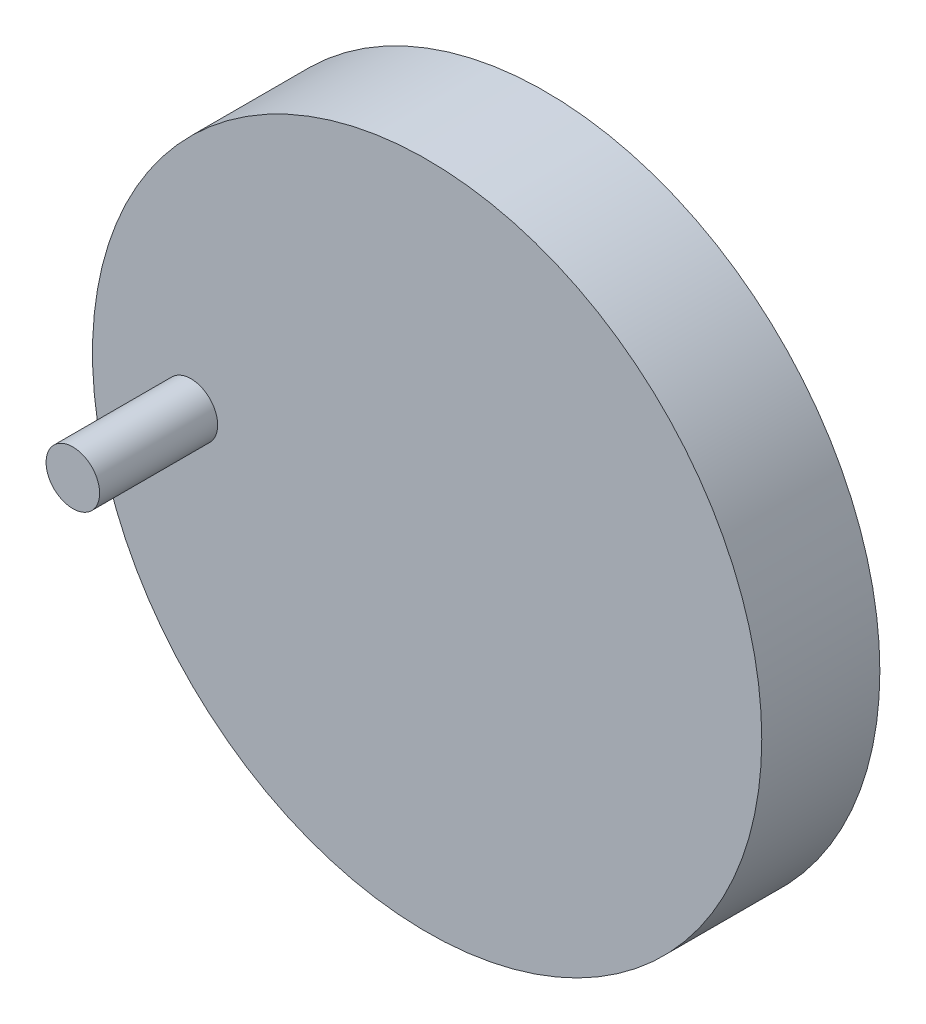
ISO-10303-21;
HEADER;
FILE_DESCRIPTION(('STEP AP214'),'2;1');
FILE_NAME('part.step','',(''),(''),'','','');
FILE_SCHEMA(('AUTOMOTIVE_DESIGN { 1 0 10303 214 1 1 1 1 }'));
ENDSEC;
DATA;
#1=APPLICATION_CONTEXT('core data for automotive mechanical design processes');
#2=APPLICATION_PROTOCOL_DEFINITION('international standard','automotive_design',2000,#1);
#3=PRODUCT_CONTEXT('',#1,'mechanical');
#4=PRODUCT('Part','Part','',(#3));
#5=PRODUCT_RELATED_PRODUCT_CATEGORY('part','',(#4));
#6=PRODUCT_DEFINITION_FORMATION('','',#4);
#7=PRODUCT_DEFINITION_CONTEXT('part definition',#1,'design');
#8=PRODUCT_DEFINITION('design','',#6,#7);
#9=PRODUCT_DEFINITION_SHAPE('','',#8);
#10=(LENGTH_UNIT() NAMED_UNIT(*) SI_UNIT(.MILLI.,.METRE.));
#11=(NAMED_UNIT(*) PLANE_ANGLE_UNIT() SI_UNIT($,.RADIAN.));
#12=(NAMED_UNIT(*) SI_UNIT($,.STERADIAN.) SOLID_ANGLE_UNIT());
#13=UNCERTAINTY_MEASURE_WITH_UNIT(LENGTH_MEASURE(1.E-05),#10,'distance_accuracy_value','');
#14=(GEOMETRIC_REPRESENTATION_CONTEXT(3) GLOBAL_UNCERTAINTY_ASSIGNED_CONTEXT((#13)) GLOBAL_UNIT_ASSIGNED_CONTEXT((#10,
#11,#12)) REPRESENTATION_CONTEXT('',''));
#15=CARTESIAN_POINT('',(0.,0.,0.));
#16=DIRECTION('',(0.,0.,1.));
#17=DIRECTION('',(1.,0.,0.));
#18=AXIS2_PLACEMENT_3D('',#15,#16,#17);
#19=CARTESIAN_POINT('',(0.,0.,10.));
#20=DIRECTION('',(0.,0.,1.));
#21=DIRECTION('',(1.,0.,0.));
#22=AXIS2_PLACEMENT_3D('',#19,#20,#21);
#23=PLANE('',#22);
#24=CARTESIAN_POINT('',(0.,0.,10.));
#25=DIRECTION('',(0.,0.,1.));
#26=DIRECTION('',(1.,0.,0.));
#27=AXIS2_PLACEMENT_3D('',#24,#25,#26);
#28=CIRCLE('',#27,28.3374661356318);
#29=CARTESIAN_POINT('',(28.3374661356318,0.,10.));
#30=VERTEX_POINT('',#29);
#31=EDGE_CURVE('E10',#30,#30,#28,.T.);
#32=ORIENTED_EDGE('',*,*,#31,.T.);
#33=EDGE_LOOP('',(#32));
#34=FACE_BOUND('',#33,.T.);
#35=CARTESIAN_POINT('',(-20.,0.,10.));
#36=DIRECTION('',(0.,0.,1.));
#37=DIRECTION('',(1.,0.,0.));
#38=AXIS2_PLACEMENT_3D('',#35,#36,#37);
#39=CIRCLE('',#38,2.26699729085055);
#40=CARTESIAN_POINT('',(-17.7330027091494,0.,10.));
#41=VERTEX_POINT('',#40);
#42=EDGE_CURVE('E41',#41,#41,#39,.T.);
#43=ORIENTED_EDGE('',*,*,#42,.F.);
#44=EDGE_LOOP('',(#43));
#45=FACE_BOUND('',#44,.T.);
#46=ADVANCED_FACE('F30',(#34,#45),#23,.T.);
#47=CARTESIAN_POINT('',(0.,0.,0.));
#48=DIRECTION('',(0.,0.,1.));
#49=DIRECTION('',(1.,0.,0.));
#50=AXIS2_PLACEMENT_3D('',#47,#48,#49);
#51=PLANE('',#50);
#52=CARTESIAN_POINT('',(0.,0.,0.));
#53=DIRECTION('',(0.,0.,1.));
#54=DIRECTION('',(1.,0.,0.));
#55=AXIS2_PLACEMENT_3D('',#52,#53,#54);
#56=CIRCLE('',#55,2.26699729085055);
#57=CARTESIAN_POINT('',(2.26699729085055,0.,0.));
#58=VERTEX_POINT('',#57);
#59=EDGE_CURVE('E45',#58,#58,#56,.F.);
#60=ORIENTED_EDGE('',*,*,#59,.F.);
#61=EDGE_LOOP('',(#60));
#62=FACE_BOUND('',#61,.T.);
#63=CARTESIAN_POINT('',(0.,0.,0.));
#64=DIRECTION('',(0.,0.,1.));
#65=DIRECTION('',(1.,0.,0.));
#66=AXIS2_PLACEMENT_3D('',#63,#64,#65);
#67=CIRCLE('',#66,28.3374661356318);
#68=CARTESIAN_POINT('',(28.3374661356318,0.,0.));
#69=VERTEX_POINT('',#68);
#70=EDGE_CURVE('E34',#69,#69,#67,.T.);
#71=ORIENTED_EDGE('',*,*,#70,.F.);
#72=EDGE_LOOP('',(#71));
#73=FACE_BOUND('',#72,.T.);
#74=ADVANCED_FACE('F71',(#62,#73),#51,.F.);
#75=CARTESIAN_POINT('',(0.,0.,10.));
#76=DIRECTION('',(0.,0.,-1.));
#77=DIRECTION('',(-1.,0.,0.));
#78=AXIS2_PLACEMENT_3D('',#75,#76,#77);
#79=CYLINDRICAL_SURFACE('',#78,28.3374661356318);
#80=ORIENTED_EDGE('',*,*,#31,.F.);
#81=EDGE_LOOP('',(#80));
#82=FACE_BOUND('',#81,.T.);
#83=ORIENTED_EDGE('',*,*,#70,.T.);
#84=EDGE_LOOP('',(#83));
#85=FACE_BOUND('',#84,.T.);
#86=ADVANCED_FACE('F32',(#82,#85),#79,.T.);
#87=CARTESIAN_POINT('',(0.,0.,10.));
#88=DIRECTION('',(0.,0.,-1.));
#89=DIRECTION('',(-1.,0.,0.));
#90=AXIS2_PLACEMENT_3D('',#87,#88,#89);
#91=CYLINDRICAL_SURFACE('',#90,2.26699729085055);
#92=CARTESIAN_POINT('',(0.,0.,-10.));
#93=DIRECTION('',(0.,0.,1.));
#94=DIRECTION('',(1.,0.,0.));
#95=AXIS2_PLACEMENT_3D('',#92,#93,#94);
#96=CIRCLE('',#95,2.26699729085055);
#97=CARTESIAN_POINT('',(2.26699729085055,0.,-10.));
#98=VERTEX_POINT('',#97);
#99=EDGE_CURVE('E48',#98,#98,#96,.T.);
#100=ORIENTED_EDGE('',*,*,#99,.T.);
#101=EDGE_LOOP('',(#100));
#102=FACE_BOUND('',#101,.T.);
#103=ORIENTED_EDGE('',*,*,#59,.T.);
#104=EDGE_LOOP('',(#103));
#105=FACE_BOUND('',#104,.T.);
#106=ADVANCED_FACE('F67',(#102,#105),#91,.T.);
#107=CARTESIAN_POINT('',(0.,0.,-10.));
#108=DIRECTION('',(0.,0.,1.));
#109=DIRECTION('',(1.,0.,0.));
#110=AXIS2_PLACEMENT_3D('',#107,#108,#109);
#111=PLANE('',#110);
#112=ORIENTED_EDGE('',*,*,#99,.F.);
#113=EDGE_LOOP('',(#112));
#114=FACE_BOUND('',#113,.T.);
#115=ADVANCED_FACE('F59',(#114),#111,.F.);
#116=CARTESIAN_POINT('',(-20.,0.,20.));
#117=DIRECTION('',(0.,0.,-1.));
#118=DIRECTION('',(-1.,0.,0.));
#119=AXIS2_PLACEMENT_3D('',#116,#117,#118);
#120=CYLINDRICAL_SURFACE('',#119,2.26699729085055);
#121=ORIENTED_EDGE('',*,*,#42,.T.);
#122=EDGE_LOOP('',(#121));
#123=FACE_BOUND('',#122,.T.);
#124=CARTESIAN_POINT('',(-20.,0.,20.));
#125=DIRECTION('',(0.,0.,1.));
#126=DIRECTION('',(1.,0.,0.));
#127=AXIS2_PLACEMENT_3D('',#124,#125,#126);
#128=CIRCLE('',#127,2.26699729085055);
#129=CARTESIAN_POINT('',(-17.7330027091494,0.,20.));
#130=VERTEX_POINT('',#129);
#131=EDGE_CURVE('E51',#130,#130,#128,.T.);
#132=ORIENTED_EDGE('',*,*,#131,.F.);
#133=EDGE_LOOP('',(#132));
#134=FACE_BOUND('',#133,.T.);
#135=ADVANCED_FACE('F57',(#123,#134),#120,.T.);
#136=CARTESIAN_POINT('',(-20.,0.,20.));
#137=DIRECTION('',(0.,0.,1.));
#138=DIRECTION('',(1.,0.,0.));
#139=AXIS2_PLACEMENT_3D('',#136,#137,#138);
#140=PLANE('',#139);
#141=ORIENTED_EDGE('',*,*,#131,.T.);
#142=EDGE_LOOP('',(#141));
#143=FACE_BOUND('',#142,.T.);
#144=ADVANCED_FACE('F55',(#143),#140,.T.);
#145=CLOSED_SHELL('',(#46,#74,#86,#106,#115,#135,#144));
#146=MANIFOLD_SOLID_BREP('B2',#145);
#147=ADVANCED_BREP_SHAPE_REPRESENTATION('',(#18,#146),#14);
#148=SHAPE_DEFINITION_REPRESENTATION(#9,#147);
ENDSEC;
END-ISO-10303-21;
